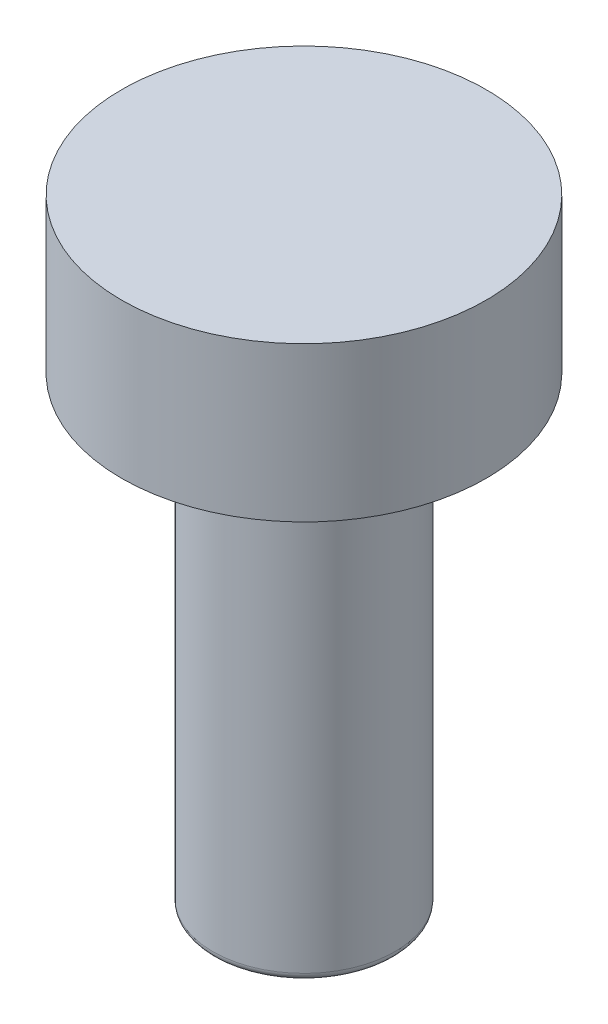
ISO-10303-21;
HEADER;
FILE_DESCRIPTION(('STEP AP214'),'2;1');
FILE_NAME('part.step','',(''),(''),'','','');
FILE_SCHEMA(('AUTOMOTIVE_DESIGN { 1 0 10303 214 1 1 1 1 }'));
ENDSEC;
DATA;
#1=APPLICATION_CONTEXT('core data for automotive mechanical design processes');
#2=APPLICATION_PROTOCOL_DEFINITION('international standard','automotive_design',2000,#1);
#3=PRODUCT_CONTEXT('',#1,'mechanical');
#4=PRODUCT('Part','Part','',(#3));
#5=PRODUCT_RELATED_PRODUCT_CATEGORY('part','',(#4));
#6=PRODUCT_DEFINITION_FORMATION('','',#4);
#7=PRODUCT_DEFINITION_CONTEXT('part definition',#1,'design');
#8=PRODUCT_DEFINITION('design','',#6,#7);
#9=PRODUCT_DEFINITION_SHAPE('','',#8);
#10=(LENGTH_UNIT() NAMED_UNIT(*) SI_UNIT(.MILLI.,.METRE.));
#11=(NAMED_UNIT(*) PLANE_ANGLE_UNIT() SI_UNIT($,.RADIAN.));
#12=(NAMED_UNIT(*) SI_UNIT($,.STERADIAN.) SOLID_ANGLE_UNIT());
#13=UNCERTAINTY_MEASURE_WITH_UNIT(LENGTH_MEASURE(1.E-05),#10,'distance_accuracy_value','');
#14=(GEOMETRIC_REPRESENTATION_CONTEXT(3) GLOBAL_UNCERTAINTY_ASSIGNED_CONTEXT((#13)) GLOBAL_UNIT_ASSIGNED_CONTEXT((#10,
#11,#12)) REPRESENTATION_CONTEXT('',''));
#15=CARTESIAN_POINT('',(0.,0.,0.));
#16=DIRECTION('',(0.,0.,1.));
#17=DIRECTION('',(1.,0.,0.));
#18=AXIS2_PLACEMENT_3D('',#15,#16,#17);
#19=CARTESIAN_POINT('',(0.,15.24,0.));
#20=DIRECTION('',(0.,-1.,0.));
#21=DIRECTION('',(0.,0.,-1.));
#22=AXIS2_PLACEMENT_3D('',#19,#20,#21);
#23=CYLINDRICAL_SURFACE('',#22,3.);
#24=DIRECTION('',(0.,-1.,0.));
#25=VECTOR('',#24,1.);
#26=CARTESIAN_POINT('',(-1.6583123951777,15.24,-2.5));
#27=LINE('',#26,#25);
#28=CARTESIAN_POINT('',(-1.6583123951777,15.24,-2.5));
#29=VERTEX_POINT('',#28);
#30=CARTESIAN_POINT('',(-1.6583123951777,0.254000000000004,-2.5));
#31=VERTEX_POINT('',#30);
#32=EDGE_CURVE('E78',#29,#31,#27,.T.);
#33=ORIENTED_EDGE('',*,*,#32,.T.);
#34=CARTESIAN_POINT('',(0.,0.254000000000001,0.));
#35=DIRECTION('',(0.,1.,0.));
#36=DIRECTION('',(0.,0.,1.));
#37=AXIS2_PLACEMENT_3D('',#34,#35,#36);
#38=CIRCLE('',#37,3.);
#39=CARTESIAN_POINT('',(1.6583123951777,0.254000000000004,-2.5));
#40=VERTEX_POINT('',#39);
#41=EDGE_CURVE('E97',#31,#40,#38,.T.);
#42=ORIENTED_EDGE('',*,*,#41,.T.);
#43=DIRECTION('',(0.,-1.,0.));
#44=VECTOR('',#43,1.);
#45=CARTESIAN_POINT('',(1.6583123951777,15.24,-2.5));
#46=LINE('',#45,#44);
#47=CARTESIAN_POINT('',(1.6583123951777,15.24,-2.5));
#48=VERTEX_POINT('',#47);
#49=EDGE_CURVE('E80',#48,#40,#46,.T.);
#50=ORIENTED_EDGE('',*,*,#49,.F.);
#51=CARTESIAN_POINT('',(0.,15.24,0.));
#52=DIRECTION('',(0.,1.,0.));
#53=DIRECTION('',(0.,0.,1.));
#54=AXIS2_PLACEMENT_3D('',#51,#52,#53);
#55=CIRCLE('',#54,3.);
#56=EDGE_CURVE('E75',#29,#48,#55,.T.);
#57=ORIENTED_EDGE('',*,*,#56,.F.);
#58=EDGE_LOOP('',(#33,#42,#50,#57));
#59=FACE_BOUND('',#58,.T.);
#60=ADVANCED_FACE('F41',(#59),#23,.T.);
#61=CARTESIAN_POINT('',(-1.6583123951777,15.24,-2.5));
#62=DIRECTION('',(0.,0.,1.));
#63=DIRECTION('',(1.,0.,0.));
#64=AXIS2_PLACEMENT_3D('',#61,#62,#63);
#65=PLANE('',#64);
#66=ORIENTED_EDGE('',*,*,#49,.T.);
#67=CARTESIAN_POINT('',(1.6583123951777,0.254,-2.5));
#68=CARTESIAN_POINT('',(1.65834630719083,0.244059875356075,-2.5));
#69=CARTESIAN_POINT('',(1.65725928694809,0.234164736378598,-2.5));
#70=CARTESIAN_POINT('',(1.65315841942144,0.214911102472651,-2.5));
#71=CARTESIAN_POINT('',(1.65017011016815,0.205547260031023,-2.5));
#72=CARTESIAN_POINT('',(1.64258707032973,0.187571752269606,-2.5));
#73=CARTESIAN_POINT('',(1.6380007945087,0.178956420603629,-2.5));
#74=CARTESIAN_POINT('',(1.6275619466495,0.162505156939808,-2.5));
#75=CARTESIAN_POINT('',(1.62170494244431,0.154672096716128,-2.5));
#76=CARTESIAN_POINT('',(1.6054721427079,0.135648625695657,-2.5));
#77=CARTESIAN_POINT('',(1.59440794320042,0.125048722950261,-2.5));
#78=CARTESIAN_POINT('',(1.57080768956811,0.10566898719676,-2.5));
#79=CARTESIAN_POINT('',(1.5582689315096,0.0968925821190616,-2.5));
#80=CARTESIAN_POINT('',(1.52267483271435,0.0750078452182879,-2.5));
#81=CARTESIAN_POINT('',(1.49866772563261,0.0634612953429399,-2.5));
#82=CARTESIAN_POINT('',(1.44918872324886,0.0438706285822024,-2.5));
#83=CARTESIAN_POINT('',(1.42370873802583,0.0358484556101634,-2.5));
#84=CARTESIAN_POINT('',(1.3762998787191,0.0236774179294141,-2.5));
#85=CARTESIAN_POINT('',(1.3544754031136,0.0191087162564639,-2.5));
#86=CARTESIAN_POINT('',(1.31053211815979,0.0115783557698712,-2.5));
#87=CARTESIAN_POINT('',(1.28841300150506,0.00861853577596258,-2.5));
#88=CARTESIAN_POINT('',(1.24457339798071,0.0041086532428982,-2.5));
#89=CARTESIAN_POINT('',(1.22285606412711,0.00252650057851506,-2.5));
#90=CARTESIAN_POINT('',(1.17942557049391,0.000476817484113863,-2.5));
#91=CARTESIAN_POINT('',(1.15771255502657,6.31600238617094E-06,-2.5));
#92=CARTESIAN_POINT('',(1.13600880278279,0.,-2.5));
#93=B_SPLINE_CURVE_WITH_KNOTS('',3,(#67,#68,#69,#70,#71,#72,#73,#74,#75,#76,#77,#78,#79,#80,#81,
#82,#83,#84,#85,#86,#87,#88,#89,#90,#91,#92),.UNSPECIFIED.,.F.,.F.,(4,2,2,2,2,2,2,2,2,2,2,2,4),
(0.,0.0296899117797629,0.0589892146951551,0.08813579320358,0.11738571482508,0.163091872721407,
0.208883189809037,0.288355236521133,0.368315321731643,0.435137519980115,0.502035930790672,
0.567330848118562,0.632451056767971),.UNSPECIFIED.);
#94=CARTESIAN_POINT('',(1.13600880278279,0.,-2.5));
#95=VERTEX_POINT('',#94);
#96=EDGE_CURVE('E50',#40,#95,#93,.T.);
#97=ORIENTED_EDGE('',*,*,#96,.T.);
#98=DIRECTION('',(-1.,0.,0.));
#99=VECTOR('',#98,1.);
#100=CARTESIAN_POINT('',(-1.6583123951777,0.,-2.5));
#101=LINE('',#100,#99);
#102=CARTESIAN_POINT('',(-1.13600880278279,0.,-2.5));
#103=VERTEX_POINT('',#102);
#104=EDGE_CURVE('E84',#95,#103,#101,.T.);
#105=ORIENTED_EDGE('',*,*,#104,.T.);
#106=CARTESIAN_POINT('',(-1.13600880278279,0.,-2.5));
#107=CARTESIAN_POINT('',(-1.16065235480402,1.11459003386159E-05,-2.5));
#108=CARTESIAN_POINT('',(-1.18531339730423,0.000615310342429845,-2.5));
#109=CARTESIAN_POINT('',(-1.23467092535179,0.00328719316787024,-2.5));
#110=CARTESIAN_POINT('',(-1.25936702222696,0.00536185428548761,-2.5));
#111=CARTESIAN_POINT('',(-1.30880871178257,0.0112873201916675,-2.5));
#112=CARTESIAN_POINT('',(-1.33355225460313,0.0151559697300236,-2.5));
#113=CARTESIAN_POINT('',(-1.38256708234245,0.0250640775051474,-2.5));
#114=CARTESIAN_POINT('',(-1.4068392679519,0.0310988523349348,-2.5));
#115=CARTESIAN_POINT('',(-1.4462871135044,0.0433228039225613,-2.5));
#116=CARTESIAN_POINT('',(-1.46170233620814,0.0487349370334995,-2.5));
#117=CARTESIAN_POINT('',(-1.49198638716515,0.0609251602477906,-2.5));
#118=CARTESIAN_POINT('',(-1.50685545989171,0.0677026301531256,-2.5));
#119=CARTESIAN_POINT('',(-1.53587852121488,0.0829394223040336,-2.5));
#120=CARTESIAN_POINT('',(-1.55002548893858,0.0914123369805136,-2.5));
#121=CARTESIAN_POINT('',(-1.57696093835197,0.11031490570702,-2.5));
#122=CARTESIAN_POINT('',(-1.58975201013227,0.120740719779437,-2.5));
#123=CARTESIAN_POINT('',(-1.60873859272692,0.139501771333271,-2.5));
#124=CARTESIAN_POINT('',(-1.6156074304609,0.147152431921255,-2.5));
#125=CARTESIAN_POINT('',(-1.62817748480593,0.163369592839771,-2.5));
#126=CARTESIAN_POINT('',(-1.6338797122177,0.171935290462777,-2.5));
#127=CARTESIAN_POINT('',(-1.64301012965948,0.188599131873127,-2.5));
#128=CARTESIAN_POINT('',(-1.64664946824753,0.196580619383376,-2.5));
#129=CARTESIAN_POINT('',(-1.65254346942069,0.213034473299288,-2.5));
#130=CARTESIAN_POINT('',(-1.65480137089634,0.221505640129725,-2.5));
#131=CARTESIAN_POINT('',(-1.65694878296659,0.234048023927444,-2.5));
#132=CARTESIAN_POINT('',(-1.6574587387884,0.238019667690081,-2.5));
#133=CARTESIAN_POINT('',(-1.65814087671816,0.24599344062219,-2.5));
#134=CARTESIAN_POINT('',(-1.65831291927306,0.249995581701923,-2.5));
#135=CARTESIAN_POINT('',(-1.65831239517818,0.253999999999918,-2.5));
#136=B_SPLINE_CURVE_WITH_KNOTS('',3,(#106,#107,#108,#109,#110,#111,#112,#113,#114,#115,#116,
#117,#118,#119,#120,#121,#122,#123,#124,#125,#126,#127,#128,#129,#130,#131,#132,#133,#134,#135),
.UNSPECIFIED.,.F.,.F.,(4,2,2,2,2,2,2,2,2,2,2,2,2,2,4),(0.,0.0739505113019848,0.148252515018435,
0.223309996503959,0.29820616323563,0.347168175846042,0.396107997632647,0.445457137922304,
0.494710242885816,0.525472703551881,0.556208396368973,0.582421590595101,0.60857308797198,
0.620573352833837,0.632578572581808),.UNSPECIFIED.);
#137=EDGE_CURVE('E88',#103,#31,#136,.T.);
#138=ORIENTED_EDGE('',*,*,#137,.T.);
#139=ORIENTED_EDGE('',*,*,#32,.F.);
#140=DIRECTION('',(-1.,0.,0.));
#141=VECTOR('',#140,1.);
#142=CARTESIAN_POINT('',(-1.6583123951777,15.24,-2.5));
#143=LINE('',#142,#141);
#144=EDGE_CURVE('E83',#48,#29,#143,.T.);
#145=ORIENTED_EDGE('',*,*,#144,.F.);
#146=EDGE_LOOP('',(#66,#97,#105,#138,#139,#145));
#147=FACE_BOUND('',#146,.T.);
#148=ADVANCED_FACE('F86',(#147),#65,.F.);
#149=CARTESIAN_POINT('',(0.,0.,0.));
#150=DIRECTION('',(0.,1.,0.));
#151=DIRECTION('',(0.,0.,1.));
#152=AXIS2_PLACEMENT_3D('',#149,#150,#151);
#153=PLANE('',#152);
#154=ORIENTED_EDGE('',*,*,#104,.F.);
#155=CARTESIAN_POINT('',(0.,0.,0.));
#156=DIRECTION('',(0.,1.,0.));
#157=DIRECTION('',(0.,0.,1.));
#158=AXIS2_PLACEMENT_3D('',#155,#156,#157);
#159=CIRCLE('',#158,2.746);
#160=EDGE_CURVE('E11',#95,#103,#159,.F.);
#161=ORIENTED_EDGE('',*,*,#160,.T.);
#162=EDGE_LOOP('',(#154,#161));
#163=FACE_BOUND('',#162,.T.);
#164=ADVANCED_FACE('F111',(#163),#153,.F.);
#165=CARTESIAN_POINT('',(0.,15.24,0.));
#166=DIRECTION('',(0.,1.,0.));
#167=DIRECTION('',(0.,0.,1.));
#168=AXIS2_PLACEMENT_3D('',#165,#166,#167);
#169=PLANE('',#168);
#170=CARTESIAN_POINT('',(0.,15.24,0.));
#171=DIRECTION('',(0.,1.,0.));
#172=DIRECTION('',(0.,0.,1.));
#173=AXIS2_PLACEMENT_3D('',#170,#171,#172);
#174=CIRCLE('',#173,6.);
#175=CARTESIAN_POINT('',(0.,15.24,6.));
#176=VERTEX_POINT('',#175);
#177=EDGE_CURVE('E172',#176,#176,#174,.T.);
#178=ORIENTED_EDGE('',*,*,#177,.F.);
#179=EDGE_LOOP('',(#178));
#180=FACE_BOUND('',#179,.T.);
#181=ORIENTED_EDGE('',*,*,#144,.T.);
#182=ORIENTED_EDGE('',*,*,#56,.T.);
#183=EDGE_LOOP('',(#181,#182));
#184=FACE_BOUND('',#183,.T.);
#185=ADVANCED_FACE('F90',(#180,#184),#169,.F.);
#186=CARTESIAN_POINT('',(0.,20.32,0.));
#187=DIRECTION('',(0.,-1.,0.));
#188=DIRECTION('',(0.,0.,-1.));
#189=AXIS2_PLACEMENT_3D('',#186,#187,#188);
#190=CYLINDRICAL_SURFACE('',#189,6.);
#191=CARTESIAN_POINT('',(0.,20.32,0.));
#192=DIRECTION('',(0.,1.,0.));
#193=DIRECTION('',(0.,0.,1.));
#194=AXIS2_PLACEMENT_3D('',#191,#192,#193);
#195=CIRCLE('',#194,6.);
#196=CARTESIAN_POINT('',(0.,20.32,6.));
#197=VERTEX_POINT('',#196);
#198=EDGE_CURVE('E94',#197,#197,#195,.T.);
#199=ORIENTED_EDGE('',*,*,#198,.F.);
#200=EDGE_LOOP('',(#199));
#201=FACE_BOUND('',#200,.T.);
#202=ORIENTED_EDGE('',*,*,#177,.T.);
#203=EDGE_LOOP('',(#202));
#204=FACE_BOUND('',#203,.T.);
#205=ADVANCED_FACE('F149',(#201,#204),#190,.T.);
#206=CARTESIAN_POINT('',(0.,20.32,0.));
#207=DIRECTION('',(0.,1.,0.));
#208=DIRECTION('',(0.,0.,1.));
#209=AXIS2_PLACEMENT_3D('',#206,#207,#208);
#210=PLANE('',#209);
#211=ORIENTED_EDGE('',*,*,#198,.T.);
#212=EDGE_LOOP('',(#211));
#213=FACE_BOUND('',#212,.T.);
#214=ADVANCED_FACE('F122',(#213),#210,.T.);
#215=CARTESIAN_POINT('',(0.,0.254000000000001,0.));
#216=DIRECTION('',(0.,1.,0.));
#217=DIRECTION('',(0.,0.,1.));
#218=AXIS2_PLACEMENT_3D('',#215,#216,#217);
#219=TOROIDAL_SURFACE('',#218,2.746,0.254);
#220=ORIENTED_EDGE('',*,*,#137,.F.);
#221=ORIENTED_EDGE('',*,*,#160,.F.);
#222=ORIENTED_EDGE('',*,*,#96,.F.);
#223=ORIENTED_EDGE('',*,*,#41,.F.);
#224=EDGE_LOOP('',(#220,#221,#222,#223));
#225=FACE_BOUND('',#224,.T.);
#226=ADVANCED_FACE('F43',(#225),#219,.T.);
#227=CLOSED_SHELL('',(#60,#148,#164,#185,#205,#214,#226));
#228=MANIFOLD_SOLID_BREP('B2',#227);
#229=ADVANCED_BREP_SHAPE_REPRESENTATION('',(#18,#228),#14);
#230=SHAPE_DEFINITION_REPRESENTATION(#9,#229);
ENDSEC;
END-ISO-10303-21;
